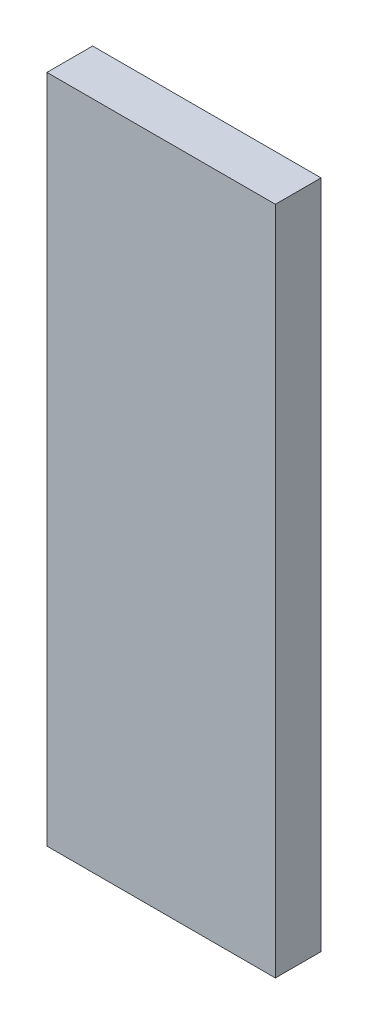
ISO-10303-21;
HEADER;
FILE_DESCRIPTION(('STEP AP214'),'2;1');
FILE_NAME('part.step','',(''),(''),'','','');
FILE_SCHEMA(('AUTOMOTIVE_DESIGN { 1 0 10303 214 1 1 1 1 }'));
ENDSEC;
DATA;
#1=APPLICATION_CONTEXT('core data for automotive mechanical design processes');
#2=APPLICATION_PROTOCOL_DEFINITION('international standard','automotive_design',2000,#1);
#3=PRODUCT_CONTEXT('',#1,'mechanical');
#4=PRODUCT('Part','Part','',(#3));
#5=PRODUCT_RELATED_PRODUCT_CATEGORY('part','',(#4));
#6=PRODUCT_DEFINITION_FORMATION('','',#4);
#7=PRODUCT_DEFINITION_CONTEXT('part definition',#1,'design');
#8=PRODUCT_DEFINITION('design','',#6,#7);
#9=PRODUCT_DEFINITION_SHAPE('','',#8);
#10=(LENGTH_UNIT() NAMED_UNIT(*) SI_UNIT(.MILLI.,.METRE.));
#11=(NAMED_UNIT(*) PLANE_ANGLE_UNIT() SI_UNIT($,.RADIAN.));
#12=(NAMED_UNIT(*) SI_UNIT($,.STERADIAN.) SOLID_ANGLE_UNIT());
#13=UNCERTAINTY_MEASURE_WITH_UNIT(LENGTH_MEASURE(1.E-05),#10,'distance_accuracy_value','');
#14=(GEOMETRIC_REPRESENTATION_CONTEXT(3) GLOBAL_UNCERTAINTY_ASSIGNED_CONTEXT((#13)) GLOBAL_UNIT_ASSIGNED_CONTEXT((#10,
#11,#12)) REPRESENTATION_CONTEXT('',''));
#15=CARTESIAN_POINT('',(0.,0.,0.));
#16=DIRECTION('',(0.,0.,1.));
#17=DIRECTION('',(1.,0.,0.));
#18=AXIS2_PLACEMENT_3D('',#15,#16,#17);
#19=CARTESIAN_POINT('',(7.5,-22.,3.));
#20=DIRECTION('',(-1.,0.,0.));
#21=DIRECTION('',(0.,0.,1.));
#22=AXIS2_PLACEMENT_3D('',#19,#20,#21);
#23=PLANE('',#22);
#24=DIRECTION('',(0.,1.,0.));
#25=VECTOR('',#24,1.);
#26=CARTESIAN_POINT('',(7.5,-22.,0.));
#27=LINE('',#26,#25);
#28=CARTESIAN_POINT('',(7.5,-22.,0.));
#29=VERTEX_POINT('',#28);
#30=CARTESIAN_POINT('',(7.5,22.,0.));
#31=VERTEX_POINT('',#30);
#32=EDGE_CURVE('E111',#29,#31,#27,.T.);
#33=ORIENTED_EDGE('',*,*,#32,.T.);
#34=DIRECTION('',(0.,0.,-1.));
#35=VECTOR('',#34,1.);
#36=CARTESIAN_POINT('',(7.5,22.,3.));
#37=LINE('',#36,#35);
#38=CARTESIAN_POINT('',(7.5,22.,3.));
#39=VERTEX_POINT('',#38);
#40=EDGE_CURVE('E11',#39,#31,#37,.T.);
#41=ORIENTED_EDGE('',*,*,#40,.F.);
#42=DIRECTION('',(0.,1.,0.));
#43=VECTOR('',#42,1.);
#44=CARTESIAN_POINT('',(7.5,-22.,3.));
#45=LINE('',#44,#43);
#46=CARTESIAN_POINT('',(7.5,-22.,3.));
#47=VERTEX_POINT('',#46);
#48=EDGE_CURVE('E95',#47,#39,#45,.T.);
#49=ORIENTED_EDGE('',*,*,#48,.F.);
#50=DIRECTION('',(0.,0.,-1.));
#51=VECTOR('',#50,1.);
#52=CARTESIAN_POINT('',(7.5,-22.,3.));
#53=LINE('',#52,#51);
#54=EDGE_CURVE('E107',#47,#29,#53,.T.);
#55=ORIENTED_EDGE('',*,*,#54,.T.);
#56=EDGE_LOOP('',(#33,#41,#49,#55));
#57=FACE_BOUND('',#56,.T.);
#58=ADVANCED_FACE('F43',(#57),#23,.F.);
#59=CARTESIAN_POINT('',(-7.5,22.,3.));
#60=DIRECTION('',(0.,-1.,0.));
#61=DIRECTION('',(0.,0.,-1.));
#62=AXIS2_PLACEMENT_3D('',#59,#60,#61);
#63=PLANE('',#62);
#64=DIRECTION('',(-1.,0.,0.));
#65=VECTOR('',#64,1.);
#66=CARTESIAN_POINT('',(-7.5,22.,0.));
#67=LINE('',#66,#65);
#68=CARTESIAN_POINT('',(-7.5,22.,0.));
#69=VERTEX_POINT('',#68);
#70=EDGE_CURVE('E100',#31,#69,#67,.T.);
#71=ORIENTED_EDGE('',*,*,#70,.T.);
#72=DIRECTION('',(0.,0.,-1.));
#73=VECTOR('',#72,1.);
#74=CARTESIAN_POINT('',(-7.5,22.,3.));
#75=LINE('',#74,#73);
#76=CARTESIAN_POINT('',(-7.5,22.,3.));
#77=VERTEX_POINT('',#76);
#78=EDGE_CURVE('E52',#77,#69,#75,.T.);
#79=ORIENTED_EDGE('',*,*,#78,.F.);
#80=DIRECTION('',(-1.,0.,0.));
#81=VECTOR('',#80,1.);
#82=CARTESIAN_POINT('',(-7.5,22.,3.));
#83=LINE('',#82,#81);
#84=EDGE_CURVE('E90',#39,#77,#83,.T.);
#85=ORIENTED_EDGE('',*,*,#84,.F.);
#86=ORIENTED_EDGE('',*,*,#40,.T.);
#87=EDGE_LOOP('',(#71,#79,#85,#86));
#88=FACE_BOUND('',#87,.T.);
#89=ADVANCED_FACE('F99',(#88),#63,.F.);
#90=CARTESIAN_POINT('',(-7.5,-22.,3.));
#91=DIRECTION('',(1.,0.,0.));
#92=DIRECTION('',(0.,0.,-1.));
#93=AXIS2_PLACEMENT_3D('',#90,#91,#92);
#94=PLANE('',#93);
#95=DIRECTION('',(0.,-1.,0.));
#96=VECTOR('',#95,1.);
#97=CARTESIAN_POINT('',(-7.5,-22.,0.));
#98=LINE('',#97,#96);
#99=CARTESIAN_POINT('',(-7.5,-22.,0.));
#100=VERTEX_POINT('',#99);
#101=EDGE_CURVE('E77',#69,#100,#98,.T.);
#102=ORIENTED_EDGE('',*,*,#101,.T.);
#103=DIRECTION('',(0.,0.,-1.));
#104=VECTOR('',#103,1.);
#105=CARTESIAN_POINT('',(-7.5,-22.,3.));
#106=LINE('',#105,#104);
#107=CARTESIAN_POINT('',(-7.5,-22.,3.));
#108=VERTEX_POINT('',#107);
#109=EDGE_CURVE('E102',#108,#100,#106,.T.);
#110=ORIENTED_EDGE('',*,*,#109,.F.);
#111=DIRECTION('',(0.,-1.,0.));
#112=VECTOR('',#111,1.);
#113=CARTESIAN_POINT('',(-7.5,-22.,3.));
#114=LINE('',#113,#112);
#115=EDGE_CURVE('E93',#77,#108,#114,.T.);
#116=ORIENTED_EDGE('',*,*,#115,.F.);
#117=ORIENTED_EDGE('',*,*,#78,.T.);
#118=EDGE_LOOP('',(#102,#110,#116,#117));
#119=FACE_BOUND('',#118,.T.);
#120=ADVANCED_FACE('F103',(#119),#94,.F.);
#121=CARTESIAN_POINT('',(-7.5,-22.,3.));
#122=DIRECTION('',(0.,1.,0.));
#123=DIRECTION('',(0.,0.,1.));
#124=AXIS2_PLACEMENT_3D('',#121,#122,#123);
#125=PLANE('',#124);
#126=DIRECTION('',(1.,0.,0.));
#127=VECTOR('',#126,1.);
#128=CARTESIAN_POINT('',(-7.5,-22.,0.));
#129=LINE('',#128,#127);
#130=EDGE_CURVE('E83',#100,#29,#129,.T.);
#131=ORIENTED_EDGE('',*,*,#130,.T.);
#132=ORIENTED_EDGE('',*,*,#54,.F.);
#133=DIRECTION('',(1.,0.,0.));
#134=VECTOR('',#133,1.);
#135=CARTESIAN_POINT('',(-7.5,-22.,3.));
#136=LINE('',#135,#134);
#137=EDGE_CURVE('E60',#108,#47,#136,.T.);
#138=ORIENTED_EDGE('',*,*,#137,.F.);
#139=ORIENTED_EDGE('',*,*,#109,.T.);
#140=EDGE_LOOP('',(#131,#132,#138,#139));
#141=FACE_BOUND('',#140,.T.);
#142=ADVANCED_FACE('F124',(#141),#125,.F.);
#143=CARTESIAN_POINT('',(0.,0.,3.));
#144=DIRECTION('',(0.,0.,-1.));
#145=DIRECTION('',(-1.,0.,0.));
#146=AXIS2_PLACEMENT_3D('',#143,#144,#145);
#147=PLANE('',#146);
#148=ORIENTED_EDGE('',*,*,#48,.T.);
#149=ORIENTED_EDGE('',*,*,#84,.T.);
#150=ORIENTED_EDGE('',*,*,#115,.T.);
#151=ORIENTED_EDGE('',*,*,#137,.T.);
#152=EDGE_LOOP('',(#148,#149,#150,#151));
#153=FACE_BOUND('',#152,.T.);
#154=ADVANCED_FACE('F91',(#153),#147,.F.);
#155=CARTESIAN_POINT('',(0.,0.,0.));
#156=DIRECTION('',(0.,0.,-1.));
#157=DIRECTION('',(-1.,0.,0.));
#158=AXIS2_PLACEMENT_3D('',#155,#156,#157);
#159=PLANE('',#158);
#160=ORIENTED_EDGE('',*,*,#32,.F.);
#161=ORIENTED_EDGE('',*,*,#130,.F.);
#162=ORIENTED_EDGE('',*,*,#101,.F.);
#163=ORIENTED_EDGE('',*,*,#70,.F.);
#164=EDGE_LOOP('',(#160,#161,#162,#163));
#165=FACE_BOUND('',#164,.T.);
#166=ADVANCED_FACE('F127',(#165),#159,.T.);
#167=CLOSED_SHELL('',(#58,#89,#120,#142,#154,#166));
#168=MANIFOLD_SOLID_BREP('B2',#167);
#169=ADVANCED_BREP_SHAPE_REPRESENTATION('',(#18,#168),#14);
#170=SHAPE_DEFINITION_REPRESENTATION(#9,#169);
ENDSEC;
END-ISO-10303-21;
